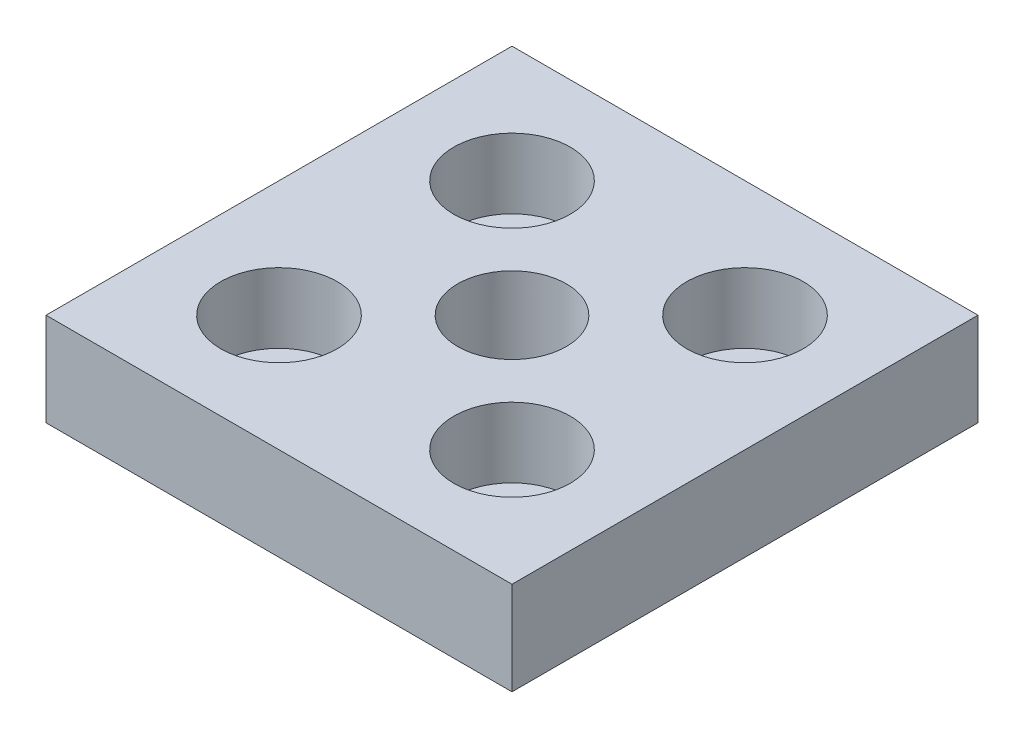
ISO-10303-21;
HEADER;
FILE_DESCRIPTION(('STEP AP214'),'2;1');
FILE_NAME('part.step','',(''),(''),'','','');
FILE_SCHEMA(('AUTOMOTIVE_DESIGN { 1 0 10303 214 1 1 1 1 }'));
ENDSEC;
DATA;
#1=APPLICATION_CONTEXT('core data for automotive mechanical design processes');
#2=APPLICATION_PROTOCOL_DEFINITION('international standard','automotive_design',2000,#1);
#3=PRODUCT_CONTEXT('',#1,'mechanical');
#4=PRODUCT('Part','Part','',(#3));
#5=PRODUCT_RELATED_PRODUCT_CATEGORY('part','',(#4));
#6=PRODUCT_DEFINITION_FORMATION('','',#4);
#7=PRODUCT_DEFINITION_CONTEXT('part definition',#1,'design');
#8=PRODUCT_DEFINITION('design','',#6,#7);
#9=PRODUCT_DEFINITION_SHAPE('','',#8);
#10=(LENGTH_UNIT() NAMED_UNIT(*) SI_UNIT(.MILLI.,.METRE.));
#11=(NAMED_UNIT(*) PLANE_ANGLE_UNIT() SI_UNIT($,.RADIAN.));
#12=(NAMED_UNIT(*) SI_UNIT($,.STERADIAN.) SOLID_ANGLE_UNIT());
#13=UNCERTAINTY_MEASURE_WITH_UNIT(LENGTH_MEASURE(1.E-05),#10,'distance_accuracy_value','');
#14=(GEOMETRIC_REPRESENTATION_CONTEXT(3) GLOBAL_UNCERTAINTY_ASSIGNED_CONTEXT((#13)) GLOBAL_UNIT_ASSIGNED_CONTEXT((#10,
#11,#12)) REPRESENTATION_CONTEXT('',''));
#15=CARTESIAN_POINT('',(0.,0.,0.));
#16=DIRECTION('',(0.,0.,1.));
#17=DIRECTION('',(1.,0.,0.));
#18=AXIS2_PLACEMENT_3D('',#15,#16,#17);
#19=CARTESIAN_POINT('',(-15.,0.,-15.));
#20=DIRECTION('',(0.,1.,0.));
#21=DIRECTION('',(0.,0.,1.));
#22=AXIS2_PLACEMENT_3D('',#19,#20,#21);
#23=CYLINDRICAL_SURFACE('',#22,4.5);
#24=CARTESIAN_POINT('',(-15.,0.,-15.));
#25=DIRECTION('',(0.,1.,0.));
#26=DIRECTION('',(0.,0.,1.));
#27=AXIS2_PLACEMENT_3D('',#24,#25,#26);
#28=CIRCLE('',#27,4.5);
#29=CARTESIAN_POINT('',(-15.,0.,-10.5));
#30=VERTEX_POINT('',#29);
#31=EDGE_CURVE('E137',#30,#30,#28,.T.);
#32=ORIENTED_EDGE('',*,*,#31,.F.);
#33=EDGE_LOOP('',(#32));
#34=FACE_BOUND('',#33,.T.);
#35=CARTESIAN_POINT('',(-15.,3.,-15.));
#36=DIRECTION('',(0.,1.,0.));
#37=DIRECTION('',(0.,0.,1.));
#38=AXIS2_PLACEMENT_3D('',#35,#36,#37);
#39=CIRCLE('',#38,4.5);
#40=CARTESIAN_POINT('',(-15.,3.,-10.5));
#41=VERTEX_POINT('',#40);
#42=EDGE_CURVE('E41',#41,#41,#39,.F.);
#43=ORIENTED_EDGE('',*,*,#42,.F.);
#44=EDGE_LOOP('',(#43));
#45=FACE_BOUND('',#44,.T.);
#46=ADVANCED_FACE('F37',(#34,#45),#23,.F.);
#47=CARTESIAN_POINT('',(15.,0.,-15.));
#48=DIRECTION('',(0.,1.,0.));
#49=DIRECTION('',(0.,0.,1.));
#50=AXIS2_PLACEMENT_3D('',#47,#48,#49);
#51=CYLINDRICAL_SURFACE('',#50,4.5);
#52=CARTESIAN_POINT('',(15.,0.,-15.));
#53=DIRECTION('',(0.,1.,0.));
#54=DIRECTION('',(0.,0.,1.));
#55=AXIS2_PLACEMENT_3D('',#52,#53,#54);
#56=CIRCLE('',#55,4.5);
#57=CARTESIAN_POINT('',(15.,0.,-10.5));
#58=VERTEX_POINT('',#57);
#59=EDGE_CURVE('E133',#58,#58,#56,.T.);
#60=ORIENTED_EDGE('',*,*,#59,.F.);
#61=EDGE_LOOP('',(#60));
#62=FACE_BOUND('',#61,.T.);
#63=CARTESIAN_POINT('',(15.,3.,-15.));
#64=DIRECTION('',(0.,1.,0.));
#65=DIRECTION('',(0.,0.,1.));
#66=AXIS2_PLACEMENT_3D('',#63,#64,#65);
#67=CIRCLE('',#66,4.5);
#68=CARTESIAN_POINT('',(15.,3.,-10.5));
#69=VERTEX_POINT('',#68);
#70=EDGE_CURVE('E119',#69,#69,#67,.F.);
#71=ORIENTED_EDGE('',*,*,#70,.F.);
#72=EDGE_LOOP('',(#71));
#73=FACE_BOUND('',#72,.T.);
#74=ADVANCED_FACE('F165',(#62,#73),#51,.F.);
#75=CARTESIAN_POINT('',(15.,0.,15.));
#76=DIRECTION('',(0.,1.,0.));
#77=DIRECTION('',(0.,0.,1.));
#78=AXIS2_PLACEMENT_3D('',#75,#76,#77);
#79=CYLINDRICAL_SURFACE('',#78,4.5);
#80=CARTESIAN_POINT('',(15.,0.,15.));
#81=DIRECTION('',(0.,1.,0.));
#82=DIRECTION('',(0.,0.,1.));
#83=AXIS2_PLACEMENT_3D('',#80,#81,#82);
#84=CIRCLE('',#83,4.5);
#85=CARTESIAN_POINT('',(15.,0.,19.5));
#86=VERTEX_POINT('',#85);
#87=EDGE_CURVE('E128',#86,#86,#84,.T.);
#88=ORIENTED_EDGE('',*,*,#87,.F.);
#89=EDGE_LOOP('',(#88));
#90=FACE_BOUND('',#89,.T.);
#91=CARTESIAN_POINT('',(15.,3.,15.));
#92=DIRECTION('',(0.,1.,0.));
#93=DIRECTION('',(0.,0.,1.));
#94=AXIS2_PLACEMENT_3D('',#91,#92,#93);
#95=CIRCLE('',#94,4.5);
#96=CARTESIAN_POINT('',(15.,3.,19.5));
#97=VERTEX_POINT('',#96);
#98=EDGE_CURVE('E116',#97,#97,#95,.F.);
#99=ORIENTED_EDGE('',*,*,#98,.F.);
#100=EDGE_LOOP('',(#99));
#101=FACE_BOUND('',#100,.T.);
#102=ADVANCED_FACE('F171',(#90,#101),#79,.F.);
#103=CARTESIAN_POINT('',(-15.,0.,15.));
#104=DIRECTION('',(0.,1.,0.));
#105=DIRECTION('',(0.,0.,1.));
#106=AXIS2_PLACEMENT_3D('',#103,#104,#105);
#107=CYLINDRICAL_SURFACE('',#106,4.5);
#108=CARTESIAN_POINT('',(-15.,0.,15.));
#109=DIRECTION('',(0.,1.,0.));
#110=DIRECTION('',(0.,0.,1.));
#111=AXIS2_PLACEMENT_3D('',#108,#109,#110);
#112=CIRCLE('',#111,4.5);
#113=CARTESIAN_POINT('',(-15.,0.,19.5));
#114=VERTEX_POINT('',#113);
#115=EDGE_CURVE('E124',#114,#114,#112,.T.);
#116=ORIENTED_EDGE('',*,*,#115,.F.);
#117=EDGE_LOOP('',(#116));
#118=FACE_BOUND('',#117,.T.);
#119=CARTESIAN_POINT('',(-15.,3.,15.));
#120=DIRECTION('',(0.,1.,0.));
#121=DIRECTION('',(0.,0.,1.));
#122=AXIS2_PLACEMENT_3D('',#119,#120,#121);
#123=CIRCLE('',#122,4.5);
#124=CARTESIAN_POINT('',(-15.,3.,19.5));
#125=VERTEX_POINT('',#124);
#126=EDGE_CURVE('E113',#125,#125,#123,.F.);
#127=ORIENTED_EDGE('',*,*,#126,.F.);
#128=EDGE_LOOP('',(#127));
#129=FACE_BOUND('',#128,.T.);
#130=ADVANCED_FACE('F178',(#118,#129),#107,.F.);
#131=CARTESIAN_POINT('',(30.,12.,30.));
#132=DIRECTION('',(-1.,0.,0.));
#133=DIRECTION('',(0.,0.,1.));
#134=AXIS2_PLACEMENT_3D('',#131,#132,#133);
#135=PLANE('',#134);
#136=DIRECTION('',(0.,0.,-1.));
#137=VECTOR('',#136,1.);
#138=CARTESIAN_POINT('',(30.,0.,30.));
#139=LINE('',#138,#137);
#140=CARTESIAN_POINT('',(30.,0.,30.));
#141=VERTEX_POINT('',#140);
#142=CARTESIAN_POINT('',(30.,0.,-30.));
#143=VERTEX_POINT('',#142);
#144=EDGE_CURVE('E104',#141,#143,#139,.T.);
#145=ORIENTED_EDGE('',*,*,#144,.T.);
#146=DIRECTION('',(0.,-1.,0.));
#147=VECTOR('',#146,1.);
#148=CARTESIAN_POINT('',(30.,12.,-30.));
#149=LINE('',#148,#147);
#150=CARTESIAN_POINT('',(30.,12.,-30.));
#151=VERTEX_POINT('',#150);
#152=EDGE_CURVE('E11',#151,#143,#149,.T.);
#153=ORIENTED_EDGE('',*,*,#152,.F.);
#154=DIRECTION('',(0.,0.,-1.));
#155=VECTOR('',#154,1.);
#156=CARTESIAN_POINT('',(30.,12.,30.));
#157=LINE('',#156,#155);
#158=CARTESIAN_POINT('',(30.,12.,30.));
#159=VERTEX_POINT('',#158);
#160=EDGE_CURVE('E91',#159,#151,#157,.T.);
#161=ORIENTED_EDGE('',*,*,#160,.F.);
#162=DIRECTION('',(0.,-1.,0.));
#163=VECTOR('',#162,1.);
#164=CARTESIAN_POINT('',(30.,12.,30.));
#165=LINE('',#164,#163);
#166=EDGE_CURVE('E100',#159,#141,#165,.T.);
#167=ORIENTED_EDGE('',*,*,#166,.T.);
#168=EDGE_LOOP('',(#145,#153,#161,#167));
#169=FACE_BOUND('',#168,.T.);
#170=ADVANCED_FACE('F39',(#169),#135,.F.);
#171=CARTESIAN_POINT('',(-30.,12.,-30.));
#172=DIRECTION('',(0.,0.,1.));
#173=DIRECTION('',(1.,0.,0.));
#174=AXIS2_PLACEMENT_3D('',#171,#172,#173);
#175=PLANE('',#174);
#176=DIRECTION('',(-1.,0.,0.));
#177=VECTOR('',#176,1.);
#178=CARTESIAN_POINT('',(-30.,0.,-30.));
#179=LINE('',#178,#177);
#180=CARTESIAN_POINT('',(-30.,0.,-30.));
#181=VERTEX_POINT('',#180);
#182=EDGE_CURVE('E95',#143,#181,#179,.T.);
#183=ORIENTED_EDGE('',*,*,#182,.T.);
#184=DIRECTION('',(0.,-1.,0.));
#185=VECTOR('',#184,1.);
#186=CARTESIAN_POINT('',(-30.,12.,-30.));
#187=LINE('',#186,#185);
#188=CARTESIAN_POINT('',(-30.,12.,-30.));
#189=VERTEX_POINT('',#188);
#190=EDGE_CURVE('E47',#189,#181,#187,.T.);
#191=ORIENTED_EDGE('',*,*,#190,.F.);
#192=DIRECTION('',(-1.,0.,0.));
#193=VECTOR('',#192,1.);
#194=CARTESIAN_POINT('',(-30.,12.,-30.));
#195=LINE('',#194,#193);
#196=EDGE_CURVE('E86',#151,#189,#195,.T.);
#197=ORIENTED_EDGE('',*,*,#196,.F.);
#198=ORIENTED_EDGE('',*,*,#152,.T.);
#199=EDGE_LOOP('',(#183,#191,#197,#198));
#200=FACE_BOUND('',#199,.T.);
#201=ADVANCED_FACE('F94',(#200),#175,.F.);
#202=CARTESIAN_POINT('',(-30.,12.,30.));
#203=DIRECTION('',(1.,0.,0.));
#204=DIRECTION('',(0.,0.,-1.));
#205=AXIS2_PLACEMENT_3D('',#202,#203,#204);
#206=PLANE('',#205);
#207=DIRECTION('',(0.,0.,1.));
#208=VECTOR('',#207,1.);
#209=CARTESIAN_POINT('',(-30.,0.,30.));
#210=LINE('',#209,#208);
#211=CARTESIAN_POINT('',(-30.,0.,30.));
#212=VERTEX_POINT('',#211);
#213=EDGE_CURVE('E73',#181,#212,#210,.T.);
#214=ORIENTED_EDGE('',*,*,#213,.T.);
#215=DIRECTION('',(0.,-1.,0.));
#216=VECTOR('',#215,1.);
#217=CARTESIAN_POINT('',(-30.,12.,30.));
#218=LINE('',#217,#216);
#219=CARTESIAN_POINT('',(-30.,12.,30.));
#220=VERTEX_POINT('',#219);
#221=EDGE_CURVE('E96',#220,#212,#218,.T.);
#222=ORIENTED_EDGE('',*,*,#221,.F.);
#223=DIRECTION('',(0.,0.,1.));
#224=VECTOR('',#223,1.);
#225=CARTESIAN_POINT('',(-30.,12.,30.));
#226=LINE('',#225,#224);
#227=EDGE_CURVE('E89',#189,#220,#226,.T.);
#228=ORIENTED_EDGE('',*,*,#227,.F.);
#229=ORIENTED_EDGE('',*,*,#190,.T.);
#230=EDGE_LOOP('',(#214,#222,#228,#229));
#231=FACE_BOUND('',#230,.T.);
#232=ADVANCED_FACE('F98',(#231),#206,.F.);
#233=CARTESIAN_POINT('',(-30.,12.,30.));
#234=DIRECTION('',(0.,0.,-1.));
#235=DIRECTION('',(-1.,0.,0.));
#236=AXIS2_PLACEMENT_3D('',#233,#234,#235);
#237=PLANE('',#236);
#238=DIRECTION('',(1.,0.,0.));
#239=VECTOR('',#238,1.);
#240=CARTESIAN_POINT('',(-30.,0.,30.));
#241=LINE('',#240,#239);
#242=EDGE_CURVE('E79',#212,#141,#241,.T.);
#243=ORIENTED_EDGE('',*,*,#242,.T.);
#244=ORIENTED_EDGE('',*,*,#166,.F.);
#245=DIRECTION('',(1.,0.,0.));
#246=VECTOR('',#245,1.);
#247=CARTESIAN_POINT('',(-30.,12.,30.));
#248=LINE('',#247,#246);
#249=EDGE_CURVE('E56',#220,#159,#248,.T.);
#250=ORIENTED_EDGE('',*,*,#249,.F.);
#251=ORIENTED_EDGE('',*,*,#221,.T.);
#252=EDGE_LOOP('',(#243,#244,#250,#251));
#253=FACE_BOUND('',#252,.T.);
#254=ADVANCED_FACE('F154',(#253),#237,.F.);
#255=CARTESIAN_POINT('',(0.,12.,0.));
#256=DIRECTION('',(0.,-1.,0.));
#257=DIRECTION('',(0.,0.,-1.));
#258=AXIS2_PLACEMENT_3D('',#255,#256,#257);
#259=PLANE('',#258);
#260=CARTESIAN_POINT('',(-15.,12.,15.));
#261=DIRECTION('',(0.,1.,0.));
#262=DIRECTION('',(0.,0.,1.));
#263=AXIS2_PLACEMENT_3D('',#260,#261,#262);
#264=CIRCLE('',#263,7.5);
#265=CARTESIAN_POINT('',(-15.,12.,22.5));
#266=VERTEX_POINT('',#265);
#267=EDGE_CURVE('E255',#266,#266,#264,.T.);
#268=ORIENTED_EDGE('',*,*,#267,.F.);
#269=EDGE_LOOP('',(#268));
#270=FACE_BOUND('',#269,.T.);
#271=CARTESIAN_POINT('',(15.,12.,15.));
#272=DIRECTION('',(0.,1.,0.));
#273=DIRECTION('',(0.,0.,1.));
#274=AXIS2_PLACEMENT_3D('',#271,#272,#273);
#275=CIRCLE('',#274,7.5);
#276=CARTESIAN_POINT('',(15.,12.,22.5));
#277=VERTEX_POINT('',#276);
#278=EDGE_CURVE('E250',#277,#277,#275,.T.);
#279=ORIENTED_EDGE('',*,*,#278,.F.);
#280=EDGE_LOOP('',(#279));
#281=FACE_BOUND('',#280,.T.);
#282=CARTESIAN_POINT('',(15.,12.,-15.));
#283=DIRECTION('',(0.,1.,0.));
#284=DIRECTION('',(0.,0.,1.));
#285=AXIS2_PLACEMENT_3D('',#282,#283,#284);
#286=CIRCLE('',#285,7.5);
#287=CARTESIAN_POINT('',(15.,12.,-7.5));
#288=VERTEX_POINT('',#287);
#289=EDGE_CURVE('E241',#288,#288,#286,.T.);
#290=ORIENTED_EDGE('',*,*,#289,.F.);
#291=EDGE_LOOP('',(#290));
#292=FACE_BOUND('',#291,.T.);
#293=CARTESIAN_POINT('',(-15.,12.,-15.));
#294=DIRECTION('',(0.,1.,0.));
#295=DIRECTION('',(0.,0.,1.));
#296=AXIS2_PLACEMENT_3D('',#293,#294,#295);
#297=CIRCLE('',#296,7.5);
#298=CARTESIAN_POINT('',(-15.,12.,-7.5));
#299=VERTEX_POINT('',#298);
#300=EDGE_CURVE('E240',#299,#299,#297,.T.);
#301=ORIENTED_EDGE('',*,*,#300,.F.);
#302=EDGE_LOOP('',(#301));
#303=FACE_BOUND('',#302,.T.);
#304=CARTESIAN_POINT('',(0.,12.,0.));
#305=DIRECTION('',(0.,1.,0.));
#306=DIRECTION('',(0.,0.,1.));
#307=AXIS2_PLACEMENT_3D('',#304,#305,#306);
#308=CIRCLE('',#307,7.);
#309=CARTESIAN_POINT('',(0.,12.,7.));
#310=VERTEX_POINT('',#309);
#311=EDGE_CURVE('E140',#310,#310,#308,.T.);
#312=ORIENTED_EDGE('',*,*,#311,.F.);
#313=EDGE_LOOP('',(#312));
#314=FACE_BOUND('',#313,.T.);
#315=ORIENTED_EDGE('',*,*,#160,.T.);
#316=ORIENTED_EDGE('',*,*,#196,.T.);
#317=ORIENTED_EDGE('',*,*,#227,.T.);
#318=ORIENTED_EDGE('',*,*,#249,.T.);
#319=EDGE_LOOP('',(#315,#316,#317,#318));
#320=FACE_BOUND('',#319,.T.);
#321=ADVANCED_FACE('F87',(#270,#281,#292,#303,#314,#320),#259,.F.);
#322=CARTESIAN_POINT('',(0.,0.,0.));
#323=DIRECTION('',(0.,-1.,0.));
#324=DIRECTION('',(0.,0.,-1.));
#325=AXIS2_PLACEMENT_3D('',#322,#323,#324);
#326=PLANE('',#325);
#327=ORIENTED_EDGE('',*,*,#115,.T.);
#328=EDGE_LOOP('',(#327));
#329=FACE_BOUND('',#328,.T.);
#330=ORIENTED_EDGE('',*,*,#87,.T.);
#331=EDGE_LOOP('',(#330));
#332=FACE_BOUND('',#331,.T.);
#333=ORIENTED_EDGE('',*,*,#59,.T.);
#334=EDGE_LOOP('',(#333));
#335=FACE_BOUND('',#334,.T.);
#336=ORIENTED_EDGE('',*,*,#31,.T.);
#337=EDGE_LOOP('',(#336));
#338=FACE_BOUND('',#337,.T.);
#339=CARTESIAN_POINT('',(0.,0.,0.));
#340=DIRECTION('',(0.,-1.,0.));
#341=DIRECTION('',(0.,0.,-1.));
#342=AXIS2_PLACEMENT_3D('',#339,#340,#341);
#343=CIRCLE('',#342,7.);
#344=CARTESIAN_POINT('',(0.,0.,-7.));
#345=VERTEX_POINT('',#344);
#346=EDGE_CURVE('E107',#345,#345,#343,.T.);
#347=ORIENTED_EDGE('',*,*,#346,.F.);
#348=EDGE_LOOP('',(#347));
#349=FACE_BOUND('',#348,.T.);
#350=ORIENTED_EDGE('',*,*,#144,.F.);
#351=ORIENTED_EDGE('',*,*,#242,.F.);
#352=ORIENTED_EDGE('',*,*,#213,.F.);
#353=ORIENTED_EDGE('',*,*,#182,.F.);
#354=EDGE_LOOP('',(#350,#351,#352,#353));
#355=FACE_BOUND('',#354,.T.);
#356=ADVANCED_FACE('F148',(#329,#332,#335,#338,#349,#355),#326,.T.);
#357=CARTESIAN_POINT('',(0.,12.,0.));
#358=DIRECTION('',(0.,1.,0.));
#359=DIRECTION('',(0.,0.,1.));
#360=AXIS2_PLACEMENT_3D('',#357,#358,#359);
#361=CYLINDRICAL_SURFACE('',#360,7.);
#362=ORIENTED_EDGE('',*,*,#311,.T.);
#363=EDGE_LOOP('',(#362));
#364=FACE_BOUND('',#363,.T.);
#365=ORIENTED_EDGE('',*,*,#346,.T.);
#366=EDGE_LOOP('',(#365));
#367=FACE_BOUND('',#366,.T.);
#368=ADVANCED_FACE('F146',(#364,#367),#361,.F.);
#369=CARTESIAN_POINT('',(-15.,3.,15.));
#370=DIRECTION('',(0.,1.,0.));
#371=DIRECTION('',(0.,0.,1.));
#372=AXIS2_PLACEMENT_3D('',#369,#370,#371);
#373=PLANE('',#372);
#374=CARTESIAN_POINT('',(-15.,3.,15.));
#375=DIRECTION('',(0.,1.,0.));
#376=DIRECTION('',(0.,0.,1.));
#377=AXIS2_PLACEMENT_3D('',#374,#375,#376);
#378=CIRCLE('',#377,7.5);
#379=CARTESIAN_POINT('',(-15.,3.,22.5));
#380=VERTEX_POINT('',#379);
#381=EDGE_CURVE('E253',#380,#380,#378,.T.);
#382=ORIENTED_EDGE('',*,*,#381,.T.);
#383=EDGE_LOOP('',(#382));
#384=FACE_BOUND('',#383,.T.);
#385=ORIENTED_EDGE('',*,*,#126,.T.);
#386=EDGE_LOOP('',(#385));
#387=FACE_BOUND('',#386,.T.);
#388=ADVANCED_FACE('F181',(#384,#387),#373,.T.);
#389=CARTESIAN_POINT('',(-15.,3.,15.));
#390=DIRECTION('',(0.,1.,0.));
#391=DIRECTION('',(0.,0.,1.));
#392=AXIS2_PLACEMENT_3D('',#389,#390,#391);
#393=CYLINDRICAL_SURFACE('',#392,7.5);
#394=ORIENTED_EDGE('',*,*,#381,.F.);
#395=EDGE_LOOP('',(#394));
#396=FACE_BOUND('',#395,.T.);
#397=ORIENTED_EDGE('',*,*,#267,.T.);
#398=EDGE_LOOP('',(#397));
#399=FACE_BOUND('',#398,.T.);
#400=ADVANCED_FACE('F186',(#396,#399),#393,.F.);
#401=CARTESIAN_POINT('',(15.,3.,15.));
#402=DIRECTION('',(0.,1.,0.));
#403=DIRECTION('',(0.,0.,1.));
#404=AXIS2_PLACEMENT_3D('',#401,#402,#403);
#405=PLANE('',#404);
#406=CARTESIAN_POINT('',(15.,3.,15.));
#407=DIRECTION('',(0.,1.,0.));
#408=DIRECTION('',(0.,0.,1.));
#409=AXIS2_PLACEMENT_3D('',#406,#407,#408);
#410=CIRCLE('',#409,7.5);
#411=CARTESIAN_POINT('',(15.,3.,22.5));
#412=VERTEX_POINT('',#411);
#413=EDGE_CURVE('E246',#412,#412,#410,.T.);
#414=ORIENTED_EDGE('',*,*,#413,.T.);
#415=EDGE_LOOP('',(#414));
#416=FACE_BOUND('',#415,.T.);
#417=ORIENTED_EDGE('',*,*,#98,.T.);
#418=EDGE_LOOP('',(#417));
#419=FACE_BOUND('',#418,.T.);
#420=ADVANCED_FACE('F194',(#416,#419),#405,.T.);
#421=CARTESIAN_POINT('',(15.,3.,15.));
#422=DIRECTION('',(0.,1.,0.));
#423=DIRECTION('',(0.,0.,1.));
#424=AXIS2_PLACEMENT_3D('',#421,#422,#423);
#425=CYLINDRICAL_SURFACE('',#424,7.5);
#426=ORIENTED_EDGE('',*,*,#413,.F.);
#427=EDGE_LOOP('',(#426));
#428=FACE_BOUND('',#427,.T.);
#429=ORIENTED_EDGE('',*,*,#278,.T.);
#430=EDGE_LOOP('',(#429));
#431=FACE_BOUND('',#430,.T.);
#432=ADVANCED_FACE('F200',(#428,#431),#425,.F.);
#433=CARTESIAN_POINT('',(15.,3.,-15.));
#434=DIRECTION('',(0.,1.,0.));
#435=DIRECTION('',(0.,0.,1.));
#436=AXIS2_PLACEMENT_3D('',#433,#434,#435);
#437=PLANE('',#436);
#438=CARTESIAN_POINT('',(15.,3.,-15.));
#439=DIRECTION('',(0.,1.,0.));
#440=DIRECTION('',(0.,0.,1.));
#441=AXIS2_PLACEMENT_3D('',#438,#439,#440);
#442=CIRCLE('',#441,7.5);
#443=CARTESIAN_POINT('',(15.,3.,-7.5));
#444=VERTEX_POINT('',#443);
#445=EDGE_CURVE('E239',#444,#444,#442,.T.);
#446=ORIENTED_EDGE('',*,*,#445,.T.);
#447=EDGE_LOOP('',(#446));
#448=FACE_BOUND('',#447,.T.);
#449=ORIENTED_EDGE('',*,*,#70,.T.);
#450=EDGE_LOOP('',(#449));
#451=FACE_BOUND('',#450,.T.);
#452=ADVANCED_FACE('F226',(#448,#451),#437,.T.);
#453=CARTESIAN_POINT('',(15.,3.,-15.));
#454=DIRECTION('',(0.,1.,0.));
#455=DIRECTION('',(0.,0.,1.));
#456=AXIS2_PLACEMENT_3D('',#453,#454,#455);
#457=CYLINDRICAL_SURFACE('',#456,7.5);
#458=ORIENTED_EDGE('',*,*,#445,.F.);
#459=EDGE_LOOP('',(#458));
#460=FACE_BOUND('',#459,.T.);
#461=ORIENTED_EDGE('',*,*,#289,.T.);
#462=EDGE_LOOP('',(#461));
#463=FACE_BOUND('',#462,.T.);
#464=ADVANCED_FACE('F207',(#460,#463),#457,.F.);
#465=CARTESIAN_POINT('',(-15.,3.,-15.));
#466=DIRECTION('',(0.,1.,0.));
#467=DIRECTION('',(0.,0.,1.));
#468=AXIS2_PLACEMENT_3D('',#465,#466,#467);
#469=PLANE('',#468);
#470=CARTESIAN_POINT('',(-15.,3.,-15.));
#471=DIRECTION('',(0.,1.,0.));
#472=DIRECTION('',(0.,0.,1.));
#473=AXIS2_PLACEMENT_3D('',#470,#471,#472);
#474=CIRCLE('',#473,7.5);
#475=CARTESIAN_POINT('',(-15.,3.,-7.5));
#476=VERTEX_POINT('',#475);
#477=EDGE_CURVE('E117',#476,#476,#474,.T.);
#478=ORIENTED_EDGE('',*,*,#477,.T.);
#479=EDGE_LOOP('',(#478));
#480=FACE_BOUND('',#479,.T.);
#481=ORIENTED_EDGE('',*,*,#42,.T.);
#482=EDGE_LOOP('',(#481));
#483=FACE_BOUND('',#482,.T.);
#484=ADVANCED_FACE('F203',(#480,#483),#469,.T.);
#485=CARTESIAN_POINT('',(-15.,3.,-15.));
#486=DIRECTION('',(0.,1.,0.));
#487=DIRECTION('',(0.,0.,1.));
#488=AXIS2_PLACEMENT_3D('',#485,#486,#487);
#489=CYLINDRICAL_SURFACE('',#488,7.5);
#490=ORIENTED_EDGE('',*,*,#477,.F.);
#491=EDGE_LOOP('',(#490));
#492=FACE_BOUND('',#491,.T.);
#493=ORIENTED_EDGE('',*,*,#300,.T.);
#494=EDGE_LOOP('',(#493));
#495=FACE_BOUND('',#494,.T.);
#496=ADVANCED_FACE('F206',(#492,#495),#489,.F.);
#497=CLOSED_SHELL('',(#46,#74,#102,#130,#170,#201,#232,#254,#321,#356,#368,#388,#400,#420,#432,
#452,#464,#484,#496));
#498=MANIFOLD_SOLID_BREP('B2',#497);
#499=ADVANCED_BREP_SHAPE_REPRESENTATION('',(#18,#498),#14);
#500=SHAPE_DEFINITION_REPRESENTATION(#9,#499);
ENDSEC;
END-ISO-10303-21;
